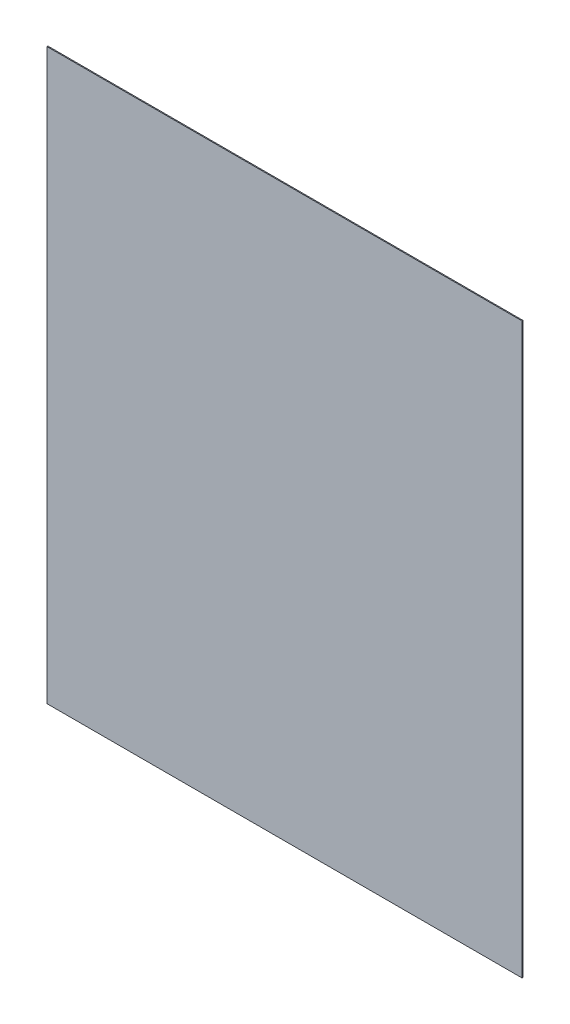
ISO-10303-21;
HEADER;
FILE_DESCRIPTION(('STEP AP214'),'2;1');
FILE_NAME('part.step','',(''),(''),'','','');
FILE_SCHEMA(('AUTOMOTIVE_DESIGN { 1 0 10303 214 1 1 1 1 }'));
ENDSEC;
DATA;
#1=APPLICATION_CONTEXT('core data for automotive mechanical design processes');
#2=APPLICATION_PROTOCOL_DEFINITION('international standard','automotive_design',2000,#1);
#3=PRODUCT_CONTEXT('',#1,'mechanical');
#4=PRODUCT('Part','Part','',(#3));
#5=PRODUCT_RELATED_PRODUCT_CATEGORY('part','',(#4));
#6=PRODUCT_DEFINITION_FORMATION('','',#4);
#7=PRODUCT_DEFINITION_CONTEXT('part definition',#1,'design');
#8=PRODUCT_DEFINITION('design','',#6,#7);
#9=PRODUCT_DEFINITION_SHAPE('','',#8);
#10=(LENGTH_UNIT() NAMED_UNIT(*) SI_UNIT(.MILLI.,.METRE.));
#11=(NAMED_UNIT(*) PLANE_ANGLE_UNIT() SI_UNIT($,.RADIAN.));
#12=(NAMED_UNIT(*) SI_UNIT($,.STERADIAN.) SOLID_ANGLE_UNIT());
#13=UNCERTAINTY_MEASURE_WITH_UNIT(LENGTH_MEASURE(1.E-05),#10,'distance_accuracy_value','');
#14=(GEOMETRIC_REPRESENTATION_CONTEXT(3) GLOBAL_UNCERTAINTY_ASSIGNED_CONTEXT((#13)) GLOBAL_UNIT_ASSIGNED_CONTEXT((#10,
#11,#12)) REPRESENTATION_CONTEXT('',''));
#15=CARTESIAN_POINT('',(0.,0.,0.));
#16=DIRECTION('',(0.,0.,1.));
#17=DIRECTION('',(1.,0.,0.));
#18=AXIS2_PLACEMENT_3D('',#15,#16,#17);
#19=CARTESIAN_POINT('',(-9.246193158258E-06,-2.031834984745E-05,0.00100076));
#20=DIRECTION('',(0.,0.,1.));
#21=DIRECTION('',(1.,0.,0.));
#22=AXIS2_PLACEMENT_3D('',#19,#20,#21);
#23=PLANE('',#22);
#24=DIRECTION('',(0.,1.,0.));
#25=VECTOR('',#24,1.);
#26=CARTESIAN_POINT('',(0.25022048,-0.29969968,0.00100076));
#27=LINE('',#26,#25);
#28=CARTESIAN_POINT('',(0.25022048,-0.29969968,0.00100076));
#29=VERTEX_POINT('',#28);
#30=CARTESIAN_POINT('',(0.25022048,0.2996184,0.00100076));
#31=VERTEX_POINT('',#30);
#32=EDGE_CURVE('E98',#29,#31,#27,.T.);
#33=ORIENTED_EDGE('',*,*,#32,.T.);
#34=DIRECTION('',(-0.999999986810398,0.000162416759267465,0.));
#35=VECTOR('',#34,1.);
#36=CARTESIAN_POINT('',(0.25022048,0.2996184,0.00100076));
#37=LINE('',#36,#35);
#38=CARTESIAN_POINT('',(-0.25022048,0.29969968,0.00100076));
#39=VERTEX_POINT('',#38);
#40=EDGE_CURVE('E78',#31,#39,#37,.T.);
#41=ORIENTED_EDGE('',*,*,#40,.T.);
#42=DIRECTION('',(0.,-1.,0.));
#43=VECTOR('',#42,1.);
#44=CARTESIAN_POINT('',(-0.25022048,0.29969968,0.00100076));
#45=LINE('',#44,#43);
#46=CARTESIAN_POINT('',(-0.25022048,-0.29969968,0.00100076));
#47=VERTEX_POINT('',#46);
#48=EDGE_CURVE('E83',#39,#47,#45,.T.);
#49=ORIENTED_EDGE('',*,*,#48,.T.);
#50=DIRECTION('',(1.,0.,0.));
#51=VECTOR('',#50,1.);
#52=CARTESIAN_POINT('',(-0.25022048,-0.29969968,0.00100076));
#53=LINE('',#52,#51);
#54=EDGE_CURVE('E11',#47,#29,#53,.T.);
#55=ORIENTED_EDGE('',*,*,#54,.T.);
#56=EDGE_LOOP('',(#33,#41,#49,#55));
#57=FACE_BOUND('',#56,.T.);
#58=ADVANCED_FACE('F17',(#57),#23,.T.);
#59=CARTESIAN_POINT('',(-9.246193158258E-06,-2.031834984745E-05,0.));
#60=DIRECTION('',(0.,0.,1.));
#61=DIRECTION('',(1.,0.,0.));
#62=AXIS2_PLACEMENT_3D('',#59,#60,#61);
#63=PLANE('',#62);
#64=DIRECTION('',(1.,0.,0.));
#65=VECTOR('',#64,1.);
#66=CARTESIAN_POINT('',(-0.25022048,-0.29969968,0.));
#67=LINE('',#66,#65);
#68=CARTESIAN_POINT('',(-0.25022048,-0.29969968,0.));
#69=VERTEX_POINT('',#68);
#70=CARTESIAN_POINT('',(0.25022048,-0.29969968,0.));
#71=VERTEX_POINT('',#70);
#72=EDGE_CURVE('E26',#69,#71,#67,.T.);
#73=ORIENTED_EDGE('',*,*,#72,.F.);
#74=DIRECTION('',(0.,-1.,0.));
#75=VECTOR('',#74,1.);
#76=CARTESIAN_POINT('',(-0.25022048,0.29969968,0.));
#77=LINE('',#76,#75);
#78=CARTESIAN_POINT('',(-0.25022048,0.29969968,0.));
#79=VERTEX_POINT('',#78);
#80=EDGE_CURVE('E66',#79,#69,#77,.T.);
#81=ORIENTED_EDGE('',*,*,#80,.F.);
#82=DIRECTION('',(-0.999999986810398,0.000162416759267465,0.));
#83=VECTOR('',#82,1.);
#84=CARTESIAN_POINT('',(0.25022048,0.2996184,0.));
#85=LINE('',#84,#83);
#86=CARTESIAN_POINT('',(0.25022048,0.2996184,0.));
#87=VERTEX_POINT('',#86);
#88=EDGE_CURVE('E71',#87,#79,#85,.T.);
#89=ORIENTED_EDGE('',*,*,#88,.F.);
#90=DIRECTION('',(0.,1.,0.));
#91=VECTOR('',#90,1.);
#92=CARTESIAN_POINT('',(0.25022048,-0.29969968,0.));
#93=LINE('',#92,#91);
#94=EDGE_CURVE('E113',#71,#87,#93,.T.);
#95=ORIENTED_EDGE('',*,*,#94,.F.);
#96=EDGE_LOOP('',(#73,#81,#89,#95));
#97=FACE_BOUND('',#96,.T.);
#98=ADVANCED_FACE('F68',(#97),#63,.F.);
#99=CARTESIAN_POINT('',(-0.25022048,-0.29969968,0.));
#100=DIRECTION('',(0.,1.,0.));
#101=DIRECTION('',(1.,0.,0.));
#102=AXIS2_PLACEMENT_3D('',#99,#100,#101);
#103=PLANE('',#102);
#104=ORIENTED_EDGE('',*,*,#72,.T.);
#105=DIRECTION('',(0.,0.,1.));
#106=VECTOR('',#105,1.);
#107=CARTESIAN_POINT('',(0.25022048,-0.29969968,0.));
#108=LINE('',#107,#106);
#109=EDGE_CURVE('E93',#71,#29,#108,.T.);
#110=ORIENTED_EDGE('',*,*,#109,.T.);
#111=ORIENTED_EDGE('',*,*,#54,.F.);
#112=DIRECTION('',(0.,0.,1.));
#113=VECTOR('',#112,1.);
#114=CARTESIAN_POINT('',(-0.25022048,-0.29969968,0.));
#115=LINE('',#114,#113);
#116=EDGE_CURVE('E77',#69,#47,#115,.T.);
#117=ORIENTED_EDGE('',*,*,#116,.F.);
#118=EDGE_LOOP('',(#104,#110,#111,#117));
#119=FACE_BOUND('',#118,.T.);
#120=ADVANCED_FACE('F108',(#119),#103,.F.);
#121=CARTESIAN_POINT('',(-0.25022048,0.29969968,0.));
#122=DIRECTION('',(1.,0.,0.));
#123=DIRECTION('',(0.,1.,0.));
#124=AXIS2_PLACEMENT_3D('',#121,#122,#123);
#125=PLANE('',#124);
#126=ORIENTED_EDGE('',*,*,#80,.T.);
#127=ORIENTED_EDGE('',*,*,#116,.T.);
#128=ORIENTED_EDGE('',*,*,#48,.F.);
#129=DIRECTION('',(0.,0.,1.));
#130=VECTOR('',#129,1.);
#131=CARTESIAN_POINT('',(-0.25022048,0.29969968,0.));
#132=LINE('',#131,#130);
#133=EDGE_CURVE('E81',#79,#39,#132,.T.);
#134=ORIENTED_EDGE('',*,*,#133,.F.);
#135=EDGE_LOOP('',(#126,#127,#128,#134));
#136=FACE_BOUND('',#135,.T.);
#137=ADVANCED_FACE('F82',(#136),#125,.F.);
#138=CARTESIAN_POINT('',(0.25022048,0.2996184,0.));
#139=DIRECTION('',(-0.000162416759267465,-0.999999986810398,0.));
#140=DIRECTION('',(-0.999999986810398,0.000162416759267465,0.));
#141=AXIS2_PLACEMENT_3D('',#138,#139,#140);
#142=PLANE('',#141);
#143=ORIENTED_EDGE('',*,*,#88,.T.);
#144=ORIENTED_EDGE('',*,*,#133,.T.);
#145=ORIENTED_EDGE('',*,*,#40,.F.);
#146=DIRECTION('',(0.,0.,1.));
#147=VECTOR('',#146,1.);
#148=CARTESIAN_POINT('',(0.25022048,0.2996184,0.));
#149=LINE('',#148,#147);
#150=EDGE_CURVE('E90',#87,#31,#149,.T.);
#151=ORIENTED_EDGE('',*,*,#150,.F.);
#152=EDGE_LOOP('',(#143,#144,#145,#151));
#153=FACE_BOUND('',#152,.T.);
#154=ADVANCED_FACE('F88',(#153),#142,.F.);
#155=CARTESIAN_POINT('',(0.25022048,-0.29969968,0.));
#156=DIRECTION('',(-1.,0.,0.));
#157=DIRECTION('',(0.,0.,1.));
#158=AXIS2_PLACEMENT_3D('',#155,#156,#157);
#159=PLANE('',#158);
#160=ORIENTED_EDGE('',*,*,#94,.T.);
#161=ORIENTED_EDGE('',*,*,#150,.T.);
#162=ORIENTED_EDGE('',*,*,#32,.F.);
#163=ORIENTED_EDGE('',*,*,#109,.F.);
#164=EDGE_LOOP('',(#160,#161,#162,#163));
#165=FACE_BOUND('',#164,.T.);
#166=ADVANCED_FACE('F112',(#165),#159,.F.);
#167=CLOSED_SHELL('',(#58,#98,#120,#137,#154,#166));
#168=MANIFOLD_SOLID_BREP('B1',#167);
#169=ADVANCED_BREP_SHAPE_REPRESENTATION('',(#18,#168),#14);
#170=SHAPE_DEFINITION_REPRESENTATION(#9,#169);
ENDSEC;
END-ISO-10303-21;
